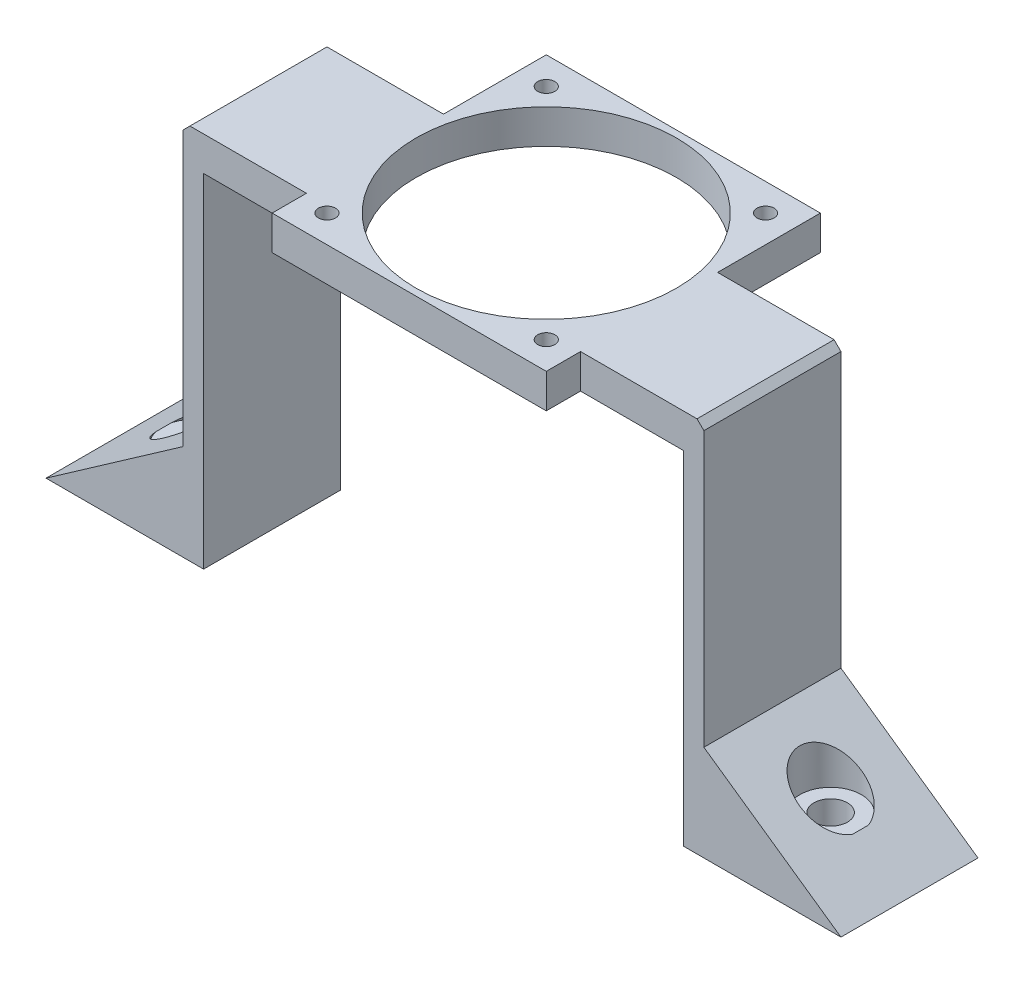
ISO-10303-21;
HEADER;
FILE_DESCRIPTION(('STEP AP214'),'2;1');
FILE_NAME('part.step','',(''),(''),'','','');
FILE_SCHEMA(('AUTOMOTIVE_DESIGN { 1 0 10303 214 1 1 1 1 }'));
ENDSEC;
DATA;
#1=APPLICATION_CONTEXT('core data for automotive mechanical design processes');
#2=APPLICATION_PROTOCOL_DEFINITION('international standard','automotive_design',2000,#1);
#3=PRODUCT_CONTEXT('',#1,'mechanical');
#4=PRODUCT('Part','Part','',(#3));
#5=PRODUCT_RELATED_PRODUCT_CATEGORY('part','',(#4));
#6=PRODUCT_DEFINITION_FORMATION('','',#4);
#7=PRODUCT_DEFINITION_CONTEXT('part definition',#1,'design');
#8=PRODUCT_DEFINITION('design','',#6,#7);
#9=PRODUCT_DEFINITION_SHAPE('','',#8);
#10=(LENGTH_UNIT() NAMED_UNIT(*) SI_UNIT(.MILLI.,.METRE.));
#11=(NAMED_UNIT(*) PLANE_ANGLE_UNIT() SI_UNIT($,.RADIAN.));
#12=(NAMED_UNIT(*) SI_UNIT($,.STERADIAN.) SOLID_ANGLE_UNIT());
#13=UNCERTAINTY_MEASURE_WITH_UNIT(LENGTH_MEASURE(1.E-05),#10,'distance_accuracy_value','');
#14=(GEOMETRIC_REPRESENTATION_CONTEXT(3) GLOBAL_UNCERTAINTY_ASSIGNED_CONTEXT((#13)) GLOBAL_UNIT_ASSIGNED_CONTEXT((#10,
#11,#12)) REPRESENTATION_CONTEXT('',''));
#15=CARTESIAN_POINT('',(0.,0.,0.));
#16=DIRECTION('',(0.,0.,1.));
#17=DIRECTION('',(1.,0.,0.));
#18=AXIS2_PLACEMENT_3D('',#15,#16,#17);
#19=CARTESIAN_POINT('',(-33.5855855855856,27.9887387387387,20.));
#20=DIRECTION('',(1.,0.,0.));
#21=DIRECTION('',(0.,1.,0.));
#22=AXIS2_PLACEMENT_3D('',#19,#20,#21);
#23=PLANE('',#22);
#24=DIRECTION('',(0.,-1.,0.));
#25=VECTOR('',#24,1.);
#26=CARTESIAN_POINT('',(-33.5855855855856,27.9887387387387,20.));
#27=LINE('',#26,#25);
#28=CARTESIAN_POINT('',(-33.5855855855856,28.9887387387387,20.));
#29=VERTEX_POINT('',#28);
#30=CARTESIAN_POINT('',(-33.5855855855856,-11.0217912524107,20.));
#31=VERTEX_POINT('',#30);
#32=EDGE_CURVE('E323',#29,#31,#27,.T.);
#33=ORIENTED_EDGE('',*,*,#32,.F.);
#34=DIRECTION('',(0.,0.,-1.));
#35=VECTOR('',#34,1.);
#36=CARTESIAN_POINT('',(-33.5855855855856,28.9887387387387,0.));
#37=LINE('',#36,#35);
#38=CARTESIAN_POINT('',(-33.5855855855856,28.9887387387387,0.));
#39=VERTEX_POINT('',#38);
#40=EDGE_CURVE('E85',#29,#39,#37,.T.);
#41=ORIENTED_EDGE('',*,*,#40,.T.);
#42=DIRECTION('',(0.,-1.,0.));
#43=VECTOR('',#42,1.);
#44=CARTESIAN_POINT('',(-33.5855855855856,27.9887387387387,0.));
#45=LINE('',#44,#43);
#46=CARTESIAN_POINT('',(-33.5855855855856,-11.0217912524107,0.));
#47=VERTEX_POINT('',#46);
#48=EDGE_CURVE('E333',#39,#47,#45,.T.);
#49=ORIENTED_EDGE('',*,*,#48,.T.);
#50=DIRECTION('',(0.,0.,-1.));
#51=VECTOR('',#50,1.);
#52=CARTESIAN_POINT('',(-33.5855855855856,-11.0217912524107,20.));
#53=LINE('',#52,#51);
#54=EDGE_CURVE('E263',#31,#47,#53,.T.);
#55=ORIENTED_EDGE('',*,*,#54,.F.);
#56=EDGE_LOOP('',(#33,#41,#49,#55));
#57=FACE_BOUND('',#56,.T.);
#58=ADVANCED_FACE('F76',(#57),#23,.F.);
#59=CARTESIAN_POINT('',(-30.5855855855856,24.9887387387387,20.));
#60=DIRECTION('',(-1.,0.,0.));
#61=DIRECTION('',(0.,-1.,0.));
#62=AXIS2_PLACEMENT_3D('',#59,#60,#61);
#63=PLANE('',#62);
#64=DIRECTION('',(0.,1.,0.));
#65=VECTOR('',#64,1.);
#66=CARTESIAN_POINT('',(-30.5855855855856,24.9887387387387,0.));
#67=LINE('',#66,#65);
#68=CARTESIAN_POINT('',(-30.5855855855856,-25.0112612612613,0.));
#69=VERTEX_POINT('',#68);
#70=CARTESIAN_POINT('',(-30.5855855855856,24.9887387387387,0.));
#71=VERTEX_POINT('',#70);
#72=EDGE_CURVE('E316',#69,#71,#67,.T.);
#73=ORIENTED_EDGE('',*,*,#72,.T.);
#74=DIRECTION('',(0.,0.,-1.));
#75=VECTOR('',#74,1.);
#76=CARTESIAN_POINT('',(-30.5855855855856,24.9887387387387,20.));
#77=LINE('',#76,#75);
#78=CARTESIAN_POINT('',(-30.5855855855856,24.9887387387387,20.));
#79=VERTEX_POINT('',#78);
#80=EDGE_CURVE('E338',#79,#71,#77,.T.);
#81=ORIENTED_EDGE('',*,*,#80,.F.);
#82=DIRECTION('',(0.,1.,0.));
#83=VECTOR('',#82,1.);
#84=CARTESIAN_POINT('',(-30.5855855855856,24.9887387387387,20.));
#85=LINE('',#84,#83);
#86=CARTESIAN_POINT('',(-30.5855855855856,-25.0112612612613,20.));
#87=VERTEX_POINT('',#86);
#88=EDGE_CURVE('E317',#87,#79,#85,.T.);
#89=ORIENTED_EDGE('',*,*,#88,.F.);
#90=DIRECTION('',(0.,0.,-1.));
#91=VECTOR('',#90,1.);
#92=CARTESIAN_POINT('',(-30.5855855855856,-25.0112612612613,20.));
#93=LINE('',#92,#91);
#94=EDGE_CURVE('E327',#87,#69,#93,.T.);
#95=ORIENTED_EDGE('',*,*,#94,.T.);
#96=EDGE_LOOP('',(#73,#81,#89,#95));
#97=FACE_BOUND('',#96,.T.);
#98=ADVANCED_FACE('F482',(#97),#63,.F.);
#99=CARTESIAN_POINT('',(-30.5855855855856,24.9887387387387,20.));
#100=DIRECTION('',(0.,1.,0.));
#101=DIRECTION('',(0.,0.,1.));
#102=AXIS2_PLACEMENT_3D('',#99,#100,#101);
#103=PLANE('',#102);
#104=DIRECTION('',(0.,0.,1.));
#105=VECTOR('',#104,1.);
#106=CARTESIAN_POINT('',(24.4144144144144,24.9887387387387,25.));
#107=LINE('',#106,#105);
#108=CARTESIAN_POINT('',(24.4144144144144,24.9887387387387,20.));
#109=VERTEX_POINT('',#108);
#110=CARTESIAN_POINT('',(24.4144144144144,24.9887387387387,25.));
#111=VERTEX_POINT('',#110);
#112=EDGE_CURVE('E410',#109,#111,#107,.T.);
#113=ORIENTED_EDGE('',*,*,#112,.T.);
#114=DIRECTION('',(1.,0.,0.));
#115=VECTOR('',#114,1.);
#116=CARTESIAN_POINT('',(24.4144144144144,24.9887387387387,25.));
#117=LINE('',#116,#115);
#118=CARTESIAN_POINT('',(-15.5855855855856,24.9887387387387,25.));
#119=VERTEX_POINT('',#118);
#120=EDGE_CURVE('E306',#119,#111,#117,.T.);
#121=ORIENTED_EDGE('',*,*,#120,.F.);
#122=DIRECTION('',(0.,0.,1.));
#123=VECTOR('',#122,1.);
#124=CARTESIAN_POINT('',(-15.5855855855856,24.9887387387387,25.));
#125=LINE('',#124,#123);
#126=CARTESIAN_POINT('',(-15.5855855855856,24.9887387387387,20.));
#127=VERTEX_POINT('',#126);
#128=EDGE_CURVE('E303',#127,#119,#125,.T.);
#129=ORIENTED_EDGE('',*,*,#128,.F.);
#130=DIRECTION('',(1.,0.,0.));
#131=VECTOR('',#130,1.);
#132=CARTESIAN_POINT('',(-30.5855855855856,24.9887387387387,20.));
#133=LINE('',#132,#131);
#134=EDGE_CURVE('E320',#79,#127,#133,.T.);
#135=ORIENTED_EDGE('',*,*,#134,.F.);
#136=ORIENTED_EDGE('',*,*,#80,.T.);
#137=DIRECTION('',(1.,0.,0.));
#138=VECTOR('',#137,1.);
#139=CARTESIAN_POINT('',(-30.5855855855856,24.9887387387387,0.));
#140=LINE('',#139,#138);
#141=CARTESIAN_POINT('',(-15.5855855855856,24.9887387387387,0.));
#142=VERTEX_POINT('',#141);
#143=EDGE_CURVE('E330',#71,#142,#140,.T.);
#144=ORIENTED_EDGE('',*,*,#143,.T.);
#145=CARTESIAN_POINT('',(-15.5855855855856,24.9887387387387,-15.));
#146=VERTEX_POINT('',#145);
#147=EDGE_CURVE('E304',#146,#142,#125,.T.);
#148=ORIENTED_EDGE('',*,*,#147,.F.);
#149=DIRECTION('',(-1.,0.,0.));
#150=VECTOR('',#149,1.);
#151=CARTESIAN_POINT('',(24.4144144144144,24.9887387387387,-15.));
#152=LINE('',#151,#150);
#153=CARTESIAN_POINT('',(24.4144144144144,24.9887387387387,-15.));
#154=VERTEX_POINT('',#153);
#155=EDGE_CURVE('E301',#154,#146,#152,.T.);
#156=ORIENTED_EDGE('',*,*,#155,.F.);
#157=CARTESIAN_POINT('',(24.4144144144144,24.9887387387387,0.));
#158=VERTEX_POINT('',#157);
#159=EDGE_CURVE('E413',#154,#158,#107,.T.);
#160=ORIENTED_EDGE('',*,*,#159,.T.);
#161=DIRECTION('',(-1.,0.,0.));
#162=VECTOR('',#161,1.);
#163=CARTESIAN_POINT('',(39.4144144144144,24.9887387387387,0.));
#164=LINE('',#163,#162);
#165=CARTESIAN_POINT('',(39.4144144144144,24.9887387387387,0.));
#166=VERTEX_POINT('',#165);
#167=EDGE_CURVE('E379',#166,#158,#164,.T.);
#168=ORIENTED_EDGE('',*,*,#167,.F.);
#169=DIRECTION('',(0.,0.,-1.));
#170=VECTOR('',#169,1.);
#171=CARTESIAN_POINT('',(39.4144144144145,24.9887387387387,20.));
#172=LINE('',#171,#170);
#173=CARTESIAN_POINT('',(39.4144144144145,24.9887387387387,20.));
#174=VERTEX_POINT('',#173);
#175=EDGE_CURVE('E247',#174,#166,#172,.T.);
#176=ORIENTED_EDGE('',*,*,#175,.F.);
#177=DIRECTION('',(-1.,0.,0.));
#178=VECTOR('',#177,1.);
#179=CARTESIAN_POINT('',(39.4144144144145,24.9887387387387,20.));
#180=LINE('',#179,#178);
#181=EDGE_CURVE('E428',#174,#109,#180,.T.);
#182=ORIENTED_EDGE('',*,*,#181,.T.);
#183=EDGE_LOOP('',(#113,#121,#129,#135,#136,#144,#148,#156,#160,#168,#176,#182));
#184=FACE_BOUND('',#183,.T.);
#185=CARTESIAN_POINT('',(-11.5855855855856,24.9887387387387,-11.));
#186=DIRECTION('',(0.,1.,0.));
#187=DIRECTION('',(0.,0.,1.));
#188=AXIS2_PLACEMENT_3D('',#185,#186,#187);
#189=CIRCLE('',#188,1.25);
#190=CARTESIAN_POINT('',(-11.5855855855856,24.9887387387387,-9.75));
#191=VERTEX_POINT('',#190);
#192=EDGE_CURVE('E292',#191,#191,#189,.T.);
#193=ORIENTED_EDGE('',*,*,#192,.T.);
#194=EDGE_LOOP('',(#193));
#195=FACE_BOUND('',#194,.T.);
#196=CARTESIAN_POINT('',(-11.5855855855856,24.9887387387387,21.));
#197=DIRECTION('',(0.,1.,0.));
#198=DIRECTION('',(0.,0.,1.));
#199=AXIS2_PLACEMENT_3D('',#196,#197,#198);
#200=CIRCLE('',#199,1.25);
#201=CARTESIAN_POINT('',(-11.5855855855856,24.9887387387387,22.25));
#202=VERTEX_POINT('',#201);
#203=EDGE_CURVE('E293',#202,#202,#200,.T.);
#204=ORIENTED_EDGE('',*,*,#203,.T.);
#205=EDGE_LOOP('',(#204));
#206=FACE_BOUND('',#205,.T.);
#207=CARTESIAN_POINT('',(4.41441441441443,24.9887387387387,5.));
#208=DIRECTION('',(0.,1.,0.));
#209=DIRECTION('',(0.,0.,1.));
#210=AXIS2_PLACEMENT_3D('',#207,#208,#209);
#211=CIRCLE('',#210,19.);
#212=CARTESIAN_POINT('',(4.41441441441443,24.9887387387387,24.));
#213=VERTEX_POINT('',#212);
#214=EDGE_CURVE('E296',#213,#213,#211,.T.);
#215=ORIENTED_EDGE('',*,*,#214,.T.);
#216=EDGE_LOOP('',(#215));
#217=FACE_BOUND('',#216,.T.);
#218=CARTESIAN_POINT('',(20.4144144144144,24.9887387387387,-11.));
#219=DIRECTION('',(0.,-1.,0.));
#220=DIRECTION('',(0.,0.,1.));
#221=AXIS2_PLACEMENT_3D('',#218,#219,#220);
#222=CIRCLE('',#221,1.25);
#223=CARTESIAN_POINT('',(20.4144144144144,24.9887387387387,-9.75));
#224=VERTEX_POINT('',#223);
#225=EDGE_CURVE('E406',#224,#224,#222,.T.);
#226=ORIENTED_EDGE('',*,*,#225,.F.);
#227=EDGE_LOOP('',(#226));
#228=FACE_BOUND('',#227,.T.);
#229=CARTESIAN_POINT('',(20.4144144144144,24.9887387387387,21.));
#230=DIRECTION('',(0.,-1.,0.));
#231=DIRECTION('',(0.,0.,1.));
#232=AXIS2_PLACEMENT_3D('',#229,#230,#231);
#233=CIRCLE('',#232,1.25);
#234=CARTESIAN_POINT('',(20.4144144144144,24.9887387387387,22.25));
#235=VERTEX_POINT('',#234);
#236=EDGE_CURVE('E407',#235,#235,#233,.T.);
#237=ORIENTED_EDGE('',*,*,#236,.F.);
#238=EDGE_LOOP('',(#237));
#239=FACE_BOUND('',#238,.T.);
#240=ADVANCED_FACE('F460',(#184,#195,#206,#217,#228,#239),#103,.F.);
#241=CARTESIAN_POINT('',(-30.5855855855856,-25.0112612612613,20.));
#242=DIRECTION('',(0.,1.,0.));
#243=DIRECTION('',(-1.,0.,0.));
#244=AXIS2_PLACEMENT_3D('',#241,#242,#243);
#245=PLANE('',#244);
#246=CARTESIAN_POINT('',(-42.0855855855856,-25.0112612612613,10.));
#247=DIRECTION('',(0.,-1.,0.));
#248=DIRECTION('',(1.,0.,0.));
#249=AXIS2_PLACEMENT_3D('',#246,#247,#248);
#250=CIRCLE('',#249,2.45);
#251=CARTESIAN_POINT('',(-39.6355855855856,-25.0112612612613,10.));
#252=VERTEX_POINT('',#251);
#253=EDGE_CURVE('E253',#252,#252,#250,.T.);
#254=ORIENTED_EDGE('',*,*,#253,.F.);
#255=EDGE_LOOP('',(#254));
#256=FACE_BOUND('',#255,.T.);
#257=DIRECTION('',(1.,0.,0.));
#258=VECTOR('',#257,1.);
#259=CARTESIAN_POINT('',(-30.5855855855856,-25.0112612612613,0.));
#260=LINE('',#259,#258);
#261=CARTESIAN_POINT('',(-53.5855855855856,-25.0112612612613,0.));
#262=VERTEX_POINT('',#261);
#263=EDGE_CURVE('E321',#262,#69,#260,.T.);
#264=ORIENTED_EDGE('',*,*,#263,.T.);
#265=ORIENTED_EDGE('',*,*,#94,.F.);
#266=DIRECTION('',(1.,0.,0.));
#267=VECTOR('',#266,1.);
#268=CARTESIAN_POINT('',(-30.5855855855856,-25.0112612612613,20.));
#269=LINE('',#268,#267);
#270=CARTESIAN_POINT('',(-53.5855855855856,-25.0112612612613,20.));
#271=VERTEX_POINT('',#270);
#272=EDGE_CURVE('E325',#271,#87,#269,.T.);
#273=ORIENTED_EDGE('',*,*,#272,.F.);
#274=DIRECTION('',(0.,0.,-1.));
#275=VECTOR('',#274,1.);
#276=CARTESIAN_POINT('',(-53.5855855855856,-25.0112612612613,20.));
#277=LINE('',#276,#275);
#278=EDGE_CURVE('E260',#271,#262,#277,.T.);
#279=ORIENTED_EDGE('',*,*,#278,.T.);
#280=EDGE_LOOP('',(#264,#265,#273,#279));
#281=FACE_BOUND('',#280,.T.);
#282=ADVANCED_FACE('F514',(#256,#281),#245,.F.);
#283=CARTESIAN_POINT('',(0.,0.,20.));
#284=DIRECTION('',(0.,0.,-1.));
#285=DIRECTION('',(-1.,0.,0.));
#286=AXIS2_PLACEMENT_3D('',#283,#284,#285);
#287=PLANE('',#286);
#288=DIRECTION('',(1.,0.,0.));
#289=VECTOR('',#288,1.);
#290=CARTESIAN_POINT('',(-33.5855855855856,29.9887387387387,20.));
#291=LINE('',#290,#289);
#292=CARTESIAN_POINT('',(-32.5855855855856,29.9887387387387,20.));
#293=VERTEX_POINT('',#292);
#294=CARTESIAN_POINT('',(-15.5855855855856,29.9887387387387,20.));
#295=VERTEX_POINT('',#294);
#296=EDGE_CURVE('E277',#293,#295,#291,.T.);
#297=ORIENTED_EDGE('',*,*,#296,.F.);
#298=DIRECTION('',(-0.707106781186543,-0.707106781186552,0.));
#299=VECTOR('',#298,1.);
#300=CARTESIAN_POINT('',(-32.5855855855856,29.9887387387387,20.));
#301=LINE('',#300,#299);
#302=EDGE_CURVE('E99',#293,#29,#301,.T.);
#303=ORIENTED_EDGE('',*,*,#302,.T.);
#304=ORIENTED_EDGE('',*,*,#32,.T.);
#305=DIRECTION('',(0.819434555491074,0.573172756912911,0.));
#306=VECTOR('',#305,1.);
#307=CARTESIAN_POINT('',(-53.5855855855856,-25.0112612612613,20.));
#308=LINE('',#307,#306);
#309=EDGE_CURVE('E257',#271,#31,#308,.T.);
#310=ORIENTED_EDGE('',*,*,#309,.F.);
#311=ORIENTED_EDGE('',*,*,#272,.T.);
#312=ORIENTED_EDGE('',*,*,#88,.T.);
#313=ORIENTED_EDGE('',*,*,#134,.T.);
#314=DIRECTION('',(0.,1.,0.));
#315=VECTOR('',#314,1.);
#316=CARTESIAN_POINT('',(-15.5855855855856,0.,20.));
#317=LINE('',#316,#315);
#318=EDGE_CURVE('E311',#127,#295,#317,.T.);
#319=ORIENTED_EDGE('',*,*,#318,.T.);
#320=EDGE_LOOP('',(#297,#303,#304,#310,#311,#312,#313,#319));
#321=FACE_BOUND('',#320,.T.);
#322=ADVANCED_FACE('F476',(#321),#287,.F.);
#323=CARTESIAN_POINT('',(0.,0.,0.));
#324=DIRECTION('',(0.,0.,-1.));
#325=DIRECTION('',(-1.,0.,0.));
#326=AXIS2_PLACEMENT_3D('',#323,#324,#325);
#327=PLANE('',#326);
#328=ORIENTED_EDGE('',*,*,#48,.F.);
#329=DIRECTION('',(0.707106781186543,0.707106781186552,0.));
#330=VECTOR('',#329,1.);
#331=CARTESIAN_POINT('',(-31.2871621621624,31.287162162162,0.));
#332=LINE('',#331,#330);
#333=CARTESIAN_POINT('',(-32.5855855855856,29.9887387387387,0.));
#334=VERTEX_POINT('',#333);
#335=EDGE_CURVE('E12',#39,#334,#332,.T.);
#336=ORIENTED_EDGE('',*,*,#335,.T.);
#337=DIRECTION('',(-1.,0.,0.));
#338=VECTOR('',#337,1.);
#339=CARTESIAN_POINT('',(-15.5855855855856,29.9887387387387,0.));
#340=LINE('',#339,#338);
#341=CARTESIAN_POINT('',(-15.5855855855856,29.9887387387387,0.));
#342=VERTEX_POINT('',#341);
#343=EDGE_CURVE('E289',#342,#334,#340,.T.);
#344=ORIENTED_EDGE('',*,*,#343,.F.);
#345=DIRECTION('',(0.,1.,0.));
#346=VECTOR('',#345,1.);
#347=CARTESIAN_POINT('',(-15.5855855855856,0.,0.));
#348=LINE('',#347,#346);
#349=EDGE_CURVE('E341',#142,#342,#348,.T.);
#350=ORIENTED_EDGE('',*,*,#349,.F.);
#351=ORIENTED_EDGE('',*,*,#143,.F.);
#352=ORIENTED_EDGE('',*,*,#72,.F.);
#353=ORIENTED_EDGE('',*,*,#263,.F.);
#354=DIRECTION('',(0.819434555491074,0.573172756912911,0.));
#355=VECTOR('',#354,1.);
#356=CARTESIAN_POINT('',(-53.5855855855856,-25.0112612612613,0.));
#357=LINE('',#356,#355);
#358=EDGE_CURVE('E256',#262,#47,#357,.T.);
#359=ORIENTED_EDGE('',*,*,#358,.T.);
#360=EDGE_LOOP('',(#328,#336,#344,#350,#351,#352,#353,#359));
#361=FACE_BOUND('',#360,.T.);
#362=ADVANCED_FACE('F485',(#361),#327,.T.);
#363=CARTESIAN_POINT('',(24.4144144144144,24.9887387387387,-15.));
#364=DIRECTION('',(0.,0.,-1.));
#365=DIRECTION('',(-1.,0.,0.));
#366=AXIS2_PLACEMENT_3D('',#363,#364,#365);
#367=PLANE('',#366);
#368=DIRECTION('',(-1.,0.,0.));
#369=VECTOR('',#368,1.);
#370=CARTESIAN_POINT('',(24.4144144144144,29.9887387387387,-15.));
#371=LINE('',#370,#369);
#372=CARTESIAN_POINT('',(24.4144144144144,29.9887387387387,-15.));
#373=VERTEX_POINT('',#372);
#374=CARTESIAN_POINT('',(-15.5855855855856,29.9887387387387,-15.));
#375=VERTEX_POINT('',#374);
#376=EDGE_CURVE('E284',#373,#375,#371,.T.);
#377=ORIENTED_EDGE('',*,*,#376,.F.);
#378=DIRECTION('',(0.,1.,0.));
#379=VECTOR('',#378,1.);
#380=CARTESIAN_POINT('',(24.4144144144144,24.9887387387387,-15.));
#381=LINE('',#380,#379);
#382=EDGE_CURVE('E416',#154,#373,#381,.T.);
#383=ORIENTED_EDGE('',*,*,#382,.F.);
#384=ORIENTED_EDGE('',*,*,#155,.T.);
#385=DIRECTION('',(0.,1.,0.));
#386=VECTOR('',#385,1.);
#387=CARTESIAN_POINT('',(-15.5855855855856,24.9887387387387,-15.));
#388=LINE('',#387,#386);
#389=EDGE_CURVE('E308',#146,#375,#388,.T.);
#390=ORIENTED_EDGE('',*,*,#389,.T.);
#391=EDGE_LOOP('',(#377,#383,#384,#390));
#392=FACE_BOUND('',#391,.T.);
#393=ADVANCED_FACE('F495',(#392),#367,.T.);
#394=CARTESIAN_POINT('',(-15.5855855855856,24.9887387387387,25.));
#395=DIRECTION('',(-1.,0.,0.));
#396=DIRECTION('',(0.,0.,1.));
#397=AXIS2_PLACEMENT_3D('',#394,#395,#396);
#398=PLANE('',#397);
#399=ORIENTED_EDGE('',*,*,#147,.T.);
#400=ORIENTED_EDGE('',*,*,#349,.T.);
#401=DIRECTION('',(0.,0.,1.));
#402=VECTOR('',#401,1.);
#403=CARTESIAN_POINT('',(-15.5855855855856,29.9887387387387,-15.));
#404=LINE('',#403,#402);
#405=EDGE_CURVE('E286',#375,#342,#404,.T.);
#406=ORIENTED_EDGE('',*,*,#405,.F.);
#407=ORIENTED_EDGE('',*,*,#389,.F.);
#408=EDGE_LOOP('',(#399,#400,#406,#407));
#409=FACE_BOUND('',#408,.T.);
#410=ADVANCED_FACE('F492',(#409),#398,.T.);
#411=ORIENTED_EDGE('',*,*,#318,.F.);
#412=ORIENTED_EDGE('',*,*,#128,.T.);
#413=DIRECTION('',(0.,1.,0.));
#414=VECTOR('',#413,1.);
#415=CARTESIAN_POINT('',(-15.5855855855856,24.9887387387387,25.));
#416=LINE('',#415,#414);
#417=CARTESIAN_POINT('',(-15.5855855855856,29.9887387387387,25.));
#418=VERTEX_POINT('',#417);
#419=EDGE_CURVE('E309',#119,#418,#416,.T.);
#420=ORIENTED_EDGE('',*,*,#419,.T.);
#421=DIRECTION('',(0.,0.,1.));
#422=VECTOR('',#421,1.);
#423=CARTESIAN_POINT('',(-15.5855855855856,29.9887387387387,20.));
#424=LINE('',#423,#422);
#425=EDGE_CURVE('E279',#295,#418,#424,.T.);
#426=ORIENTED_EDGE('',*,*,#425,.F.);
#427=EDGE_LOOP('',(#411,#412,#420,#426));
#428=FACE_BOUND('',#427,.T.);
#429=ADVANCED_FACE('F474',(#428),#398,.T.);
#430=CARTESIAN_POINT('',(24.4144144144144,24.9887387387387,25.));
#431=DIRECTION('',(0.,0.,1.));
#432=DIRECTION('',(1.,0.,0.));
#433=AXIS2_PLACEMENT_3D('',#430,#431,#432);
#434=PLANE('',#433);
#435=ORIENTED_EDGE('',*,*,#120,.T.);
#436=DIRECTION('',(0.,1.,0.));
#437=VECTOR('',#436,1.);
#438=CARTESIAN_POINT('',(24.4144144144144,24.9887387387387,25.));
#439=LINE('',#438,#437);
#440=CARTESIAN_POINT('',(24.4144144144144,29.9887387387387,25.));
#441=VERTEX_POINT('',#440);
#442=EDGE_CURVE('E417',#111,#441,#439,.T.);
#443=ORIENTED_EDGE('',*,*,#442,.T.);
#444=DIRECTION('',(1.,0.,0.));
#445=VECTOR('',#444,1.);
#446=CARTESIAN_POINT('',(-15.5855855855856,29.9887387387387,25.));
#447=LINE('',#446,#445);
#448=EDGE_CURVE('E282',#418,#441,#447,.T.);
#449=ORIENTED_EDGE('',*,*,#448,.F.);
#450=ORIENTED_EDGE('',*,*,#419,.F.);
#451=EDGE_LOOP('',(#435,#443,#449,#450));
#452=FACE_BOUND('',#451,.T.);
#453=ADVANCED_FACE('F469',(#452),#434,.T.);
#454=CARTESIAN_POINT('',(4.41441441441443,24.9887387387387,5.));
#455=DIRECTION('',(0.,1.,0.));
#456=DIRECTION('',(0.,0.,1.));
#457=AXIS2_PLACEMENT_3D('',#454,#455,#456);
#458=CYLINDRICAL_SURFACE('',#457,19.);
#459=ORIENTED_EDGE('',*,*,#214,.F.);
#460=EDGE_LOOP('',(#459));
#461=FACE_BOUND('',#460,.T.);
#462=CARTESIAN_POINT('',(4.41441441441443,29.9887387387387,5.));
#463=DIRECTION('',(0.,1.,0.));
#464=DIRECTION('',(0.,0.,1.));
#465=AXIS2_PLACEMENT_3D('',#462,#463,#464);
#466=CIRCLE('',#465,19.);
#467=CARTESIAN_POINT('',(4.41441441441443,29.9887387387387,24.));
#468=VERTEX_POINT('',#467);
#469=EDGE_CURVE('E272',#468,#468,#466,.T.);
#470=ORIENTED_EDGE('',*,*,#469,.T.);
#471=EDGE_LOOP('',(#470));
#472=FACE_BOUND('',#471,.T.);
#473=ADVANCED_FACE('F556',(#461,#472),#458,.F.);
#474=CARTESIAN_POINT('',(-11.5855855855856,24.9887387387387,21.));
#475=DIRECTION('',(0.,1.,0.));
#476=DIRECTION('',(0.,0.,1.));
#477=AXIS2_PLACEMENT_3D('',#474,#475,#476);
#478=CYLINDRICAL_SURFACE('',#477,1.25);
#479=ORIENTED_EDGE('',*,*,#203,.F.);
#480=EDGE_LOOP('',(#479));
#481=FACE_BOUND('',#480,.T.);
#482=CARTESIAN_POINT('',(-11.5855855855856,29.9887387387387,21.));
#483=DIRECTION('',(0.,-1.,0.));
#484=DIRECTION('',(0.,0.,-1.));
#485=AXIS2_PLACEMENT_3D('',#482,#483,#484);
#486=CIRCLE('',#485,1.25);
#487=CARTESIAN_POINT('',(-11.5855855855856,29.9887387387387,19.75));
#488=VERTEX_POINT('',#487);
#489=EDGE_CURVE('E266',#488,#488,#486,.T.);
#490=ORIENTED_EDGE('',*,*,#489,.F.);
#491=EDGE_LOOP('',(#490));
#492=FACE_BOUND('',#491,.T.);
#493=ADVANCED_FACE('F553',(#481,#492),#478,.F.);
#494=CARTESIAN_POINT('',(-11.5855855855856,24.9887387387387,-11.));
#495=DIRECTION('',(0.,1.,0.));
#496=DIRECTION('',(0.,0.,1.));
#497=AXIS2_PLACEMENT_3D('',#494,#495,#496);
#498=CYLINDRICAL_SURFACE('',#497,1.25);
#499=ORIENTED_EDGE('',*,*,#192,.F.);
#500=EDGE_LOOP('',(#499));
#501=FACE_BOUND('',#500,.T.);
#502=CARTESIAN_POINT('',(-11.5855855855856,29.9887387387387,-11.));
#503=DIRECTION('',(0.,-1.,0.));
#504=DIRECTION('',(0.,0.,-1.));
#505=AXIS2_PLACEMENT_3D('',#502,#503,#504);
#506=CIRCLE('',#505,1.25);
#507=CARTESIAN_POINT('',(-11.5855855855856,29.9887387387387,-12.25));
#508=VERTEX_POINT('',#507);
#509=EDGE_CURVE('E269',#508,#508,#506,.T.);
#510=ORIENTED_EDGE('',*,*,#509,.F.);
#511=EDGE_LOOP('',(#510));
#512=FACE_BOUND('',#511,.T.);
#513=ADVANCED_FACE('F548',(#501,#512),#498,.F.);
#514=CARTESIAN_POINT('',(0.,29.9887387387387,0.));
#515=DIRECTION('',(0.,1.,0.));
#516=DIRECTION('',(0.,0.,1.));
#517=AXIS2_PLACEMENT_3D('',#514,#515,#516);
#518=PLANE('',#517);
#519=DIRECTION('',(-1.,0.,0.));
#520=VECTOR('',#519,1.);
#521=CARTESIAN_POINT('',(42.4144144144145,29.9887387387387,20.));
#522=LINE('',#521,#520);
#523=CARTESIAN_POINT('',(41.4144144144144,29.9887387387387,20.));
#524=VERTEX_POINT('',#523);
#525=CARTESIAN_POINT('',(24.4144144144144,29.9887387387387,20.));
#526=VERTEX_POINT('',#525);
#527=EDGE_CURVE('E385',#524,#526,#522,.T.);
#528=ORIENTED_EDGE('',*,*,#527,.F.);
#529=DIRECTION('',(0.,0.,-1.));
#530=VECTOR('',#529,1.);
#531=CARTESIAN_POINT('',(41.4144144144144,29.9887387387387,0.));
#532=LINE('',#531,#530);
#533=CARTESIAN_POINT('',(41.4144144144144,29.9887387387387,0.));
#534=VERTEX_POINT('',#533);
#535=EDGE_CURVE('E356',#524,#534,#532,.T.);
#536=ORIENTED_EDGE('',*,*,#535,.T.);
#537=DIRECTION('',(1.,0.,0.));
#538=VECTOR('',#537,1.);
#539=CARTESIAN_POINT('',(24.4144144144144,29.9887387387387,0.));
#540=LINE('',#539,#538);
#541=CARTESIAN_POINT('',(24.4144144144144,29.9887387387387,0.));
#542=VERTEX_POINT('',#541);
#543=EDGE_CURVE('E368',#542,#534,#540,.T.);
#544=ORIENTED_EDGE('',*,*,#543,.F.);
#545=DIRECTION('',(0.,0.,1.));
#546=VECTOR('',#545,1.);
#547=CARTESIAN_POINT('',(24.4144144144144,29.9887387387387,-15.));
#548=LINE('',#547,#546);
#549=EDGE_CURVE('E397',#373,#542,#548,.T.);
#550=ORIENTED_EDGE('',*,*,#549,.F.);
#551=ORIENTED_EDGE('',*,*,#376,.T.);
#552=ORIENTED_EDGE('',*,*,#405,.T.);
#553=ORIENTED_EDGE('',*,*,#343,.T.);
#554=DIRECTION('',(0.,0.,1.));
#555=VECTOR('',#554,1.);
#556=CARTESIAN_POINT('',(-32.5855855855856,29.9887387387387,20.));
#557=LINE('',#556,#555);
#558=EDGE_CURVE('E353',#334,#293,#557,.T.);
#559=ORIENTED_EDGE('',*,*,#558,.T.);
#560=ORIENTED_EDGE('',*,*,#296,.T.);
#561=ORIENTED_EDGE('',*,*,#425,.T.);
#562=ORIENTED_EDGE('',*,*,#448,.T.);
#563=DIRECTION('',(0.,0.,1.));
#564=VECTOR('',#563,1.);
#565=CARTESIAN_POINT('',(24.4144144144144,29.9887387387387,20.));
#566=LINE('',#565,#564);
#567=EDGE_CURVE('E393',#526,#441,#566,.T.);
#568=ORIENTED_EDGE('',*,*,#567,.F.);
#569=EDGE_LOOP('',(#528,#536,#544,#550,#551,#552,#553,#559,#560,#561,#562,#568));
#570=FACE_BOUND('',#569,.T.);
#571=ORIENTED_EDGE('',*,*,#469,.F.);
#572=EDGE_LOOP('',(#571));
#573=FACE_BOUND('',#572,.T.);
#574=ORIENTED_EDGE('',*,*,#489,.T.);
#575=EDGE_LOOP('',(#574));
#576=FACE_BOUND('',#575,.T.);
#577=ORIENTED_EDGE('',*,*,#509,.T.);
#578=EDGE_LOOP('',(#577));
#579=FACE_BOUND('',#578,.T.);
#580=CARTESIAN_POINT('',(20.4144144144144,29.9887387387387,21.));
#581=DIRECTION('',(0.,1.,0.));
#582=DIRECTION('',(0.,0.,-1.));
#583=AXIS2_PLACEMENT_3D('',#580,#581,#582);
#584=CIRCLE('',#583,1.25);
#585=CARTESIAN_POINT('',(20.4144144144144,29.9887387387387,19.75));
#586=VERTEX_POINT('',#585);
#587=EDGE_CURVE('E400',#586,#586,#584,.T.);
#588=ORIENTED_EDGE('',*,*,#587,.F.);
#589=EDGE_LOOP('',(#588));
#590=FACE_BOUND('',#589,.T.);
#591=CARTESIAN_POINT('',(20.4144144144144,29.9887387387387,-11.));
#592=DIRECTION('',(0.,1.,0.));
#593=DIRECTION('',(0.,0.,-1.));
#594=AXIS2_PLACEMENT_3D('',#591,#592,#593);
#595=CIRCLE('',#594,1.25);
#596=CARTESIAN_POINT('',(20.4144144144144,29.9887387387387,-12.25));
#597=VERTEX_POINT('',#596);
#598=EDGE_CURVE('E395',#597,#597,#595,.T.);
#599=ORIENTED_EDGE('',*,*,#598,.F.);
#600=EDGE_LOOP('',(#599));
#601=FACE_BOUND('',#600,.T.);
#602=ADVANCED_FACE('F390',(#570,#573,#576,#579,#590,#601),#518,.T.);
#603=CARTESIAN_POINT('',(-53.5855855855856,-25.0112612612613,20.));
#604=DIRECTION('',(-0.573172756912911,0.819434555491074,0.));
#605=DIRECTION('',(-0.819434555491074,-0.573172756912911,0.));
#606=AXIS2_PLACEMENT_3D('',#603,#604,#605);
#607=PLANE('',#606);
#608=CARTESIAN_POINT('',(-42.0855855855856,-16.9673160061722,10.));
#609=DIRECTION('',(-0.573172756912911,0.819434555491074,0.));
#610=DIRECTION('',(-0.819434555491074,-0.573172756912911,0.));
#611=AXIS2_PLACEMENT_3D('',#608,#609,#610);
#612=ELLIPSE('',#611,5.49159169557259,4.5);
#613=CARTESIAN_POINT('',(-46.4373519543806,-20.0112612612613,11.1454822003964));
#614=VERTEX_POINT('',#613);
#615=CARTESIAN_POINT('',(-46.4373519543806,-20.0112612612613,8.85451779960365));
#616=VERTEX_POINT('',#615);
#617=EDGE_CURVE('E343',#614,#616,#612,.T.);
#618=ORIENTED_EDGE('',*,*,#617,.F.);
#619=DIRECTION('',(0.,0.,1.));
#620=VECTOR('',#619,1.);
#621=CARTESIAN_POINT('',(-46.4373519543806,-20.0112612612613,20.));
#622=LINE('',#621,#620);
#623=EDGE_CURVE('E251',#616,#614,#622,.T.);
#624=ORIENTED_EDGE('',*,*,#623,.F.);
#625=EDGE_LOOP('',(#618,#624));
#626=FACE_BOUND('',#625,.T.);
#627=ORIENTED_EDGE('',*,*,#358,.F.);
#628=ORIENTED_EDGE('',*,*,#278,.F.);
#629=ORIENTED_EDGE('',*,*,#309,.T.);
#630=ORIENTED_EDGE('',*,*,#54,.T.);
#631=EDGE_LOOP('',(#627,#628,#629,#630));
#632=FACE_BOUND('',#631,.T.);
#633=ADVANCED_FACE('F535',(#626,#632),#607,.T.);
#634=CARTESIAN_POINT('',(-42.0855855855857,33.9887387387387,10.));
#635=DIRECTION('',(0.,-1.,0.));
#636=DIRECTION('',(1.,0.,0.));
#637=AXIS2_PLACEMENT_3D('',#634,#635,#636);
#638=CYLINDRICAL_SURFACE('',#637,2.45);
#639=CARTESIAN_POINT('',(-42.0855855855856,-20.0112612612613,10.));
#640=DIRECTION('',(0.,-1.,0.));
#641=DIRECTION('',(1.,0.,0.));
#642=AXIS2_PLACEMENT_3D('',#639,#640,#641);
#643=CIRCLE('',#642,2.45);
#644=CARTESIAN_POINT('',(-39.6355855855856,-20.0112612612613,10.));
#645=VERTEX_POINT('',#644);
#646=EDGE_CURVE('E244',#645,#645,#643,.F.);
#647=ORIENTED_EDGE('',*,*,#646,.T.);
#648=EDGE_LOOP('',(#647));
#649=FACE_BOUND('',#648,.T.);
#650=ORIENTED_EDGE('',*,*,#253,.T.);
#651=EDGE_LOOP('',(#650));
#652=FACE_BOUND('',#651,.T.);
#653=ADVANCED_FACE('F538',(#649,#652),#638,.F.);
#654=CARTESIAN_POINT('',(-42.0855855855856,-20.0112612612613,10.));
#655=DIRECTION('',(0.,-1.,0.));
#656=DIRECTION('',(1.,0.,0.));
#657=AXIS2_PLACEMENT_3D('',#654,#655,#656);
#658=PLANE('',#657);
#659=ORIENTED_EDGE('',*,*,#623,.T.);
#660=CARTESIAN_POINT('',(-42.0855855855856,-20.0112612612613,10.));
#661=DIRECTION('',(0.,-1.,0.));
#662=DIRECTION('',(1.,0.,0.));
#663=AXIS2_PLACEMENT_3D('',#660,#661,#662);
#664=CIRCLE('',#663,4.5);
#665=EDGE_CURVE('E240',#616,#614,#664,.T.);
#666=ORIENTED_EDGE('',*,*,#665,.F.);
#667=EDGE_LOOP('',(#659,#666));
#668=FACE_BOUND('',#667,.T.);
#669=ORIENTED_EDGE('',*,*,#646,.F.);
#670=EDGE_LOOP('',(#669));
#671=FACE_BOUND('',#670,.T.);
#672=ADVANCED_FACE('F545',(#668,#671),#658,.F.);
#673=CARTESIAN_POINT('',(-42.0855855855857,38.9887387387387,10.));
#674=DIRECTION('',(0.,-1.,0.));
#675=DIRECTION('',(1.,0.,0.));
#676=AXIS2_PLACEMENT_3D('',#673,#674,#675);
#677=CYLINDRICAL_SURFACE('',#676,4.5);
#678=ORIENTED_EDGE('',*,*,#617,.T.);
#679=ORIENTED_EDGE('',*,*,#665,.T.);
#680=EDGE_LOOP('',(#678,#679));
#681=FACE_BOUND('',#680,.T.);
#682=ADVANCED_FACE('F625',(#681),#677,.F.);
#683=CARTESIAN_POINT('',(42.4144144144145,27.9887387387387,20.));
#684=DIRECTION('',(-1.,0.,0.));
#685=DIRECTION('',(0.,1.,0.));
#686=AXIS2_PLACEMENT_3D('',#683,#684,#685);
#687=PLANE('',#686);
#688=DIRECTION('',(0.,-1.,0.));
#689=VECTOR('',#688,1.);
#690=CARTESIAN_POINT('',(42.4144144144144,27.9887387387387,0.));
#691=LINE('',#690,#689);
#692=CARTESIAN_POINT('',(42.4144144144144,28.9887387387387,0.));
#693=VERTEX_POINT('',#692);
#694=CARTESIAN_POINT('',(42.4144144144144,-11.0217912524107,0.));
#695=VERTEX_POINT('',#694);
#696=EDGE_CURVE('E365',#693,#695,#691,.T.);
#697=ORIENTED_EDGE('',*,*,#696,.F.);
#698=DIRECTION('',(0.,0.,1.));
#699=VECTOR('',#698,1.);
#700=CARTESIAN_POINT('',(42.4144144144145,28.9887387387387,20.));
#701=LINE('',#700,#699);
#702=CARTESIAN_POINT('',(42.4144144144145,28.9887387387387,20.));
#703=VERTEX_POINT('',#702);
#704=EDGE_CURVE('E348',#693,#703,#701,.T.);
#705=ORIENTED_EDGE('',*,*,#704,.T.);
#706=DIRECTION('',(0.,-1.,0.));
#707=VECTOR('',#706,1.);
#708=CARTESIAN_POINT('',(42.4144144144145,27.9887387387387,20.));
#709=LINE('',#708,#707);
#710=CARTESIAN_POINT('',(42.4144144144144,-11.0217912524107,20.));
#711=VERTEX_POINT('',#710);
#712=EDGE_CURVE('E388',#703,#711,#709,.T.);
#713=ORIENTED_EDGE('',*,*,#712,.T.);
#714=DIRECTION('',(0.,0.,-1.));
#715=VECTOR('',#714,1.);
#716=CARTESIAN_POINT('',(42.4144144144144,-11.0217912524107,20.));
#717=LINE('',#716,#715);
#718=EDGE_CURVE('E377',#711,#695,#717,.T.);
#719=ORIENTED_EDGE('',*,*,#718,.T.);
#720=EDGE_LOOP('',(#697,#705,#713,#719));
#721=FACE_BOUND('',#720,.T.);
#722=ADVANCED_FACE('F374',(#721),#687,.F.);
#723=CARTESIAN_POINT('',(39.4144144144145,24.9887387387387,20.));
#724=DIRECTION('',(1.,0.,0.));
#725=DIRECTION('',(0.,-1.,0.));
#726=AXIS2_PLACEMENT_3D('',#723,#724,#725);
#727=PLANE('',#726);
#728=DIRECTION('',(0.,1.,0.));
#729=VECTOR('',#728,1.);
#730=CARTESIAN_POINT('',(39.4144144144144,24.9887387387387,0.));
#731=LINE('',#730,#729);
#732=CARTESIAN_POINT('',(39.4144144144144,-25.0112612612613,0.));
#733=VERTEX_POINT('',#732);
#734=EDGE_CURVE('E424',#733,#166,#731,.T.);
#735=ORIENTED_EDGE('',*,*,#734,.F.);
#736=DIRECTION('',(0.,0.,-1.));
#737=VECTOR('',#736,1.);
#738=CARTESIAN_POINT('',(39.4144144144144,-25.0112612612613,20.));
#739=LINE('',#738,#737);
#740=CARTESIAN_POINT('',(39.4144144144144,-25.0112612612613,20.));
#741=VERTEX_POINT('',#740);
#742=EDGE_CURVE('E434',#741,#733,#739,.T.);
#743=ORIENTED_EDGE('',*,*,#742,.F.);
#744=DIRECTION('',(0.,1.,0.));
#745=VECTOR('',#744,1.);
#746=CARTESIAN_POINT('',(39.4144144144145,24.9887387387387,20.));
#747=LINE('',#746,#745);
#748=EDGE_CURVE('E425',#741,#174,#747,.T.);
#749=ORIENTED_EDGE('',*,*,#748,.T.);
#750=ORIENTED_EDGE('',*,*,#175,.T.);
#751=EDGE_LOOP('',(#735,#743,#749,#750));
#752=FACE_BOUND('',#751,.T.);
#753=ADVANCED_FACE('F446',(#752),#727,.F.);
#754=CARTESIAN_POINT('',(39.4144144144144,-25.0112612612613,20.));
#755=DIRECTION('',(0.,1.,0.));
#756=DIRECTION('',(1.,0.,0.));
#757=AXIS2_PLACEMENT_3D('',#754,#755,#756);
#758=PLANE('',#757);
#759=CARTESIAN_POINT('',(50.9144144144144,-25.0112612612613,9.99999999999998));
#760=DIRECTION('',(0.,1.,0.));
#761=DIRECTION('',(-1.,0.,0.));
#762=AXIS2_PLACEMENT_3D('',#759,#760,#761);
#763=CIRCLE('',#762,2.45);
#764=CARTESIAN_POINT('',(48.4644144144144,-25.0112612612613,9.99999999999998));
#765=VERTEX_POINT('',#764);
#766=EDGE_CURVE('E237',#765,#765,#763,.T.);
#767=ORIENTED_EDGE('',*,*,#766,.T.);
#768=EDGE_LOOP('',(#767));
#769=FACE_BOUND('',#768,.T.);
#770=DIRECTION('',(-1.,0.,0.));
#771=VECTOR('',#770,1.);
#772=CARTESIAN_POINT('',(39.4144144144144,-25.0112612612613,0.));
#773=LINE('',#772,#771);
#774=CARTESIAN_POINT('',(62.4144144144144,-25.0112612612613,0.));
#775=VERTEX_POINT('',#774);
#776=EDGE_CURVE('E378',#775,#733,#773,.T.);
#777=ORIENTED_EDGE('',*,*,#776,.F.);
#778=DIRECTION('',(0.,0.,-1.));
#779=VECTOR('',#778,1.);
#780=CARTESIAN_POINT('',(62.4144144144145,-25.0112612612613,20.));
#781=LINE('',#780,#779);
#782=CARTESIAN_POINT('',(62.4144144144145,-25.0112612612613,20.));
#783=VERTEX_POINT('',#782);
#784=EDGE_CURVE('E457',#783,#775,#781,.T.);
#785=ORIENTED_EDGE('',*,*,#784,.F.);
#786=DIRECTION('',(-1.,0.,0.));
#787=VECTOR('',#786,1.);
#788=CARTESIAN_POINT('',(39.4144144144144,-25.0112612612613,20.));
#789=LINE('',#788,#787);
#790=EDGE_CURVE('E432',#783,#741,#789,.T.);
#791=ORIENTED_EDGE('',*,*,#790,.T.);
#792=ORIENTED_EDGE('',*,*,#742,.T.);
#793=EDGE_LOOP('',(#777,#785,#791,#792));
#794=FACE_BOUND('',#793,.T.);
#795=ADVANCED_FACE('F455',(#769,#794),#758,.F.);
#796=CARTESIAN_POINT('',(8.82882882882886,0.,20.));
#797=DIRECTION('',(0.,0.,-1.));
#798=DIRECTION('',(1.,0.,0.));
#799=AXIS2_PLACEMENT_3D('',#796,#797,#798);
#800=PLANE('',#799);
#801=ORIENTED_EDGE('',*,*,#712,.F.);
#802=DIRECTION('',(-0.707106781186552,0.707106781186543,0.));
#803=VECTOR('',#802,1.);
#804=CARTESIAN_POINT('',(42.4144144144145,28.9887387387387,20.));
#805=LINE('',#804,#803);
#806=EDGE_CURVE('E351',#703,#524,#805,.T.);
#807=ORIENTED_EDGE('',*,*,#806,.T.);
#808=ORIENTED_EDGE('',*,*,#527,.T.);
#809=DIRECTION('',(0.,1.,0.));
#810=VECTOR('',#809,1.);
#811=CARTESIAN_POINT('',(24.4144144144144,0.,20.));
#812=LINE('',#811,#810);
#813=EDGE_CURVE('E420',#109,#526,#812,.T.);
#814=ORIENTED_EDGE('',*,*,#813,.F.);
#815=ORIENTED_EDGE('',*,*,#181,.F.);
#816=ORIENTED_EDGE('',*,*,#748,.F.);
#817=ORIENTED_EDGE('',*,*,#790,.F.);
#818=DIRECTION('',(-0.819434555491074,0.573172756912911,0.));
#819=VECTOR('',#818,1.);
#820=CARTESIAN_POINT('',(62.4144144144145,-25.0112612612613,20.));
#821=LINE('',#820,#819);
#822=EDGE_CURVE('E874',#783,#711,#821,.T.);
#823=ORIENTED_EDGE('',*,*,#822,.T.);
#824=EDGE_LOOP('',(#801,#807,#808,#814,#815,#816,#817,#823));
#825=FACE_BOUND('',#824,.T.);
#826=ADVANCED_FACE('F384',(#825),#800,.F.);
#827=CARTESIAN_POINT('',(8.82882882882885,0.,0.));
#828=DIRECTION('',(0.,0.,-1.));
#829=DIRECTION('',(1.,0.,0.));
#830=AXIS2_PLACEMENT_3D('',#827,#828,#829);
#831=PLANE('',#830);
#832=ORIENTED_EDGE('',*,*,#543,.T.);
#833=DIRECTION('',(0.707106781186552,-0.707106781186543,0.));
#834=VECTOR('',#833,1.);
#835=CARTESIAN_POINT('',(40.1159909909908,31.2871621621624,0.));
#836=LINE('',#835,#834);
#837=EDGE_CURVE('E358',#534,#693,#836,.T.);
#838=ORIENTED_EDGE('',*,*,#837,.T.);
#839=ORIENTED_EDGE('',*,*,#696,.T.);
#840=DIRECTION('',(-0.819434555491074,0.573172756912911,0.));
#841=VECTOR('',#840,1.);
#842=CARTESIAN_POINT('',(62.4144144144144,-25.0112612612613,0.));
#843=LINE('',#842,#841);
#844=EDGE_CURVE('E451',#775,#695,#843,.T.);
#845=ORIENTED_EDGE('',*,*,#844,.F.);
#846=ORIENTED_EDGE('',*,*,#776,.T.);
#847=ORIENTED_EDGE('',*,*,#734,.T.);
#848=ORIENTED_EDGE('',*,*,#167,.T.);
#849=DIRECTION('',(0.,1.,0.));
#850=VECTOR('',#849,1.);
#851=CARTESIAN_POINT('',(24.4144144144144,0.,0.));
#852=LINE('',#851,#850);
#853=EDGE_CURVE('E241',#158,#542,#852,.T.);
#854=ORIENTED_EDGE('',*,*,#853,.T.);
#855=EDGE_LOOP('',(#832,#838,#839,#845,#846,#847,#848,#854));
#856=FACE_BOUND('',#855,.T.);
#857=ADVANCED_FACE('F364',(#856),#831,.T.);
#858=CARTESIAN_POINT('',(24.4144144144144,24.9887387387387,25.));
#859=DIRECTION('',(1.,0.,0.));
#860=DIRECTION('',(0.,0.,1.));
#861=AXIS2_PLACEMENT_3D('',#858,#859,#860);
#862=PLANE('',#861);
#863=ORIENTED_EDGE('',*,*,#159,.F.);
#864=ORIENTED_EDGE('',*,*,#382,.T.);
#865=ORIENTED_EDGE('',*,*,#549,.T.);
#866=ORIENTED_EDGE('',*,*,#853,.F.);
#867=EDGE_LOOP('',(#863,#864,#865,#866));
#868=FACE_BOUND('',#867,.T.);
#869=ADVANCED_FACE('F499',(#868),#862,.T.);
#870=ORIENTED_EDGE('',*,*,#813,.T.);
#871=ORIENTED_EDGE('',*,*,#567,.T.);
#872=ORIENTED_EDGE('',*,*,#442,.F.);
#873=ORIENTED_EDGE('',*,*,#112,.F.);
#874=EDGE_LOOP('',(#870,#871,#872,#873));
#875=FACE_BOUND('',#874,.T.);
#876=ADVANCED_FACE('F466',(#875),#862,.T.);
#877=CARTESIAN_POINT('',(20.4144144144144,24.9887387387387,21.));
#878=DIRECTION('',(0.,1.,0.));
#879=DIRECTION('',(0.,0.,1.));
#880=AXIS2_PLACEMENT_3D('',#877,#878,#879);
#881=CYLINDRICAL_SURFACE('',#880,1.25);
#882=ORIENTED_EDGE('',*,*,#236,.T.);
#883=EDGE_LOOP('',(#882));
#884=FACE_BOUND('',#883,.T.);
#885=ORIENTED_EDGE('',*,*,#587,.T.);
#886=EDGE_LOOP('',(#885));
#887=FACE_BOUND('',#886,.T.);
#888=ADVANCED_FACE('F695',(#884,#887),#881,.F.);
#889=CARTESIAN_POINT('',(20.4144144144144,24.9887387387387,-11.));
#890=DIRECTION('',(0.,1.,0.));
#891=DIRECTION('',(0.,0.,1.));
#892=AXIS2_PLACEMENT_3D('',#889,#890,#891);
#893=CYLINDRICAL_SURFACE('',#892,1.25);
#894=ORIENTED_EDGE('',*,*,#225,.T.);
#895=EDGE_LOOP('',(#894));
#896=FACE_BOUND('',#895,.T.);
#897=ORIENTED_EDGE('',*,*,#598,.T.);
#898=EDGE_LOOP('',(#897));
#899=FACE_BOUND('',#898,.T.);
#900=ADVANCED_FACE('F688',(#896,#899),#893,.F.);
#901=CARTESIAN_POINT('',(62.4144144144145,-25.0112612612613,20.));
#902=DIRECTION('',(0.573172756912911,0.819434555491074,0.));
#903=DIRECTION('',(0.819434555491074,-0.573172756912911,0.));
#904=AXIS2_PLACEMENT_3D('',#901,#902,#903);
#905=PLANE('',#904);
#906=CARTESIAN_POINT('',(50.9144144144145,-16.9673160061722,9.99999999999998));
#907=DIRECTION('',(-0.573172756912911,-0.819434555491074,0.));
#908=DIRECTION('',(0.819434555491074,-0.573172756912911,0.));
#909=AXIS2_PLACEMENT_3D('',#906,#907,#908);
#910=ELLIPSE('',#909,5.49159169557259,4.5);
#911=CARTESIAN_POINT('',(55.2661807832094,-20.0112612612613,11.1454822003963));
#912=VERTEX_POINT('',#911);
#913=CARTESIAN_POINT('',(55.2661807832094,-20.0112612612613,8.85451779960363));
#914=VERTEX_POINT('',#913);
#915=EDGE_CURVE('E236',#912,#914,#910,.T.);
#916=ORIENTED_EDGE('',*,*,#915,.T.);
#917=DIRECTION('',(0.,0.,1.));
#918=VECTOR('',#917,1.);
#919=CARTESIAN_POINT('',(55.2661807832094,-20.0112612612613,20.));
#920=LINE('',#919,#918);
#921=EDGE_CURVE('E227',#914,#912,#920,.T.);
#922=ORIENTED_EDGE('',*,*,#921,.T.);
#923=EDGE_LOOP('',(#916,#922));
#924=FACE_BOUND('',#923,.T.);
#925=ORIENTED_EDGE('',*,*,#844,.T.);
#926=ORIENTED_EDGE('',*,*,#718,.F.);
#927=ORIENTED_EDGE('',*,*,#822,.F.);
#928=ORIENTED_EDGE('',*,*,#784,.T.);
#929=EDGE_LOOP('',(#925,#926,#927,#928));
#930=FACE_BOUND('',#929,.T.);
#931=ADVANCED_FACE('F234',(#924,#930),#905,.T.);
#932=CARTESIAN_POINT('',(50.9144144144145,33.9887387387387,9.99999999999998));
#933=DIRECTION('',(0.,-1.,0.));
#934=DIRECTION('',(-1.,0.,0.));
#935=AXIS2_PLACEMENT_3D('',#932,#933,#934);
#936=CYLINDRICAL_SURFACE('',#935,2.45);
#937=CARTESIAN_POINT('',(50.9144144144144,-20.0112612612613,9.99999999999998));
#938=DIRECTION('',(0.,1.,0.));
#939=DIRECTION('',(-1.,0.,0.));
#940=AXIS2_PLACEMENT_3D('',#937,#938,#939);
#941=CIRCLE('',#940,2.45);
#942=CARTESIAN_POINT('',(48.4644144144144,-20.0112612612613,9.99999999999998));
#943=VERTEX_POINT('',#942);
#944=EDGE_CURVE('E231',#943,#943,#941,.F.);
#945=ORIENTED_EDGE('',*,*,#944,.F.);
#946=EDGE_LOOP('',(#945));
#947=FACE_BOUND('',#946,.T.);
#948=ORIENTED_EDGE('',*,*,#766,.F.);
#949=EDGE_LOOP('',(#948));
#950=FACE_BOUND('',#949,.T.);
#951=ADVANCED_FACE('F674',(#947,#950),#936,.F.);
#952=CARTESIAN_POINT('',(50.9144144144145,-20.0112612612613,9.99999999999998));
#953=DIRECTION('',(0.,-1.,0.));
#954=DIRECTION('',(-1.,0.,0.));
#955=AXIS2_PLACEMENT_3D('',#952,#953,#954);
#956=PLANE('',#955);
#957=ORIENTED_EDGE('',*,*,#921,.F.);
#958=CARTESIAN_POINT('',(50.9144144144145,-20.0112612612613,9.99999999999998));
#959=DIRECTION('',(0.,1.,0.));
#960=DIRECTION('',(-1.,0.,0.));
#961=AXIS2_PLACEMENT_3D('',#958,#959,#960);
#962=CIRCLE('',#961,4.5);
#963=EDGE_CURVE('E223',#914,#912,#962,.T.);
#964=ORIENTED_EDGE('',*,*,#963,.T.);
#965=EDGE_LOOP('',(#957,#964));
#966=FACE_BOUND('',#965,.T.);
#967=ORIENTED_EDGE('',*,*,#944,.T.);
#968=EDGE_LOOP('',(#967));
#969=FACE_BOUND('',#968,.T.);
#970=ADVANCED_FACE('F225',(#966,#969),#956,.F.);
#971=CARTESIAN_POINT('',(50.9144144144145,38.9887387387387,9.99999999999998));
#972=DIRECTION('',(0.,-1.,0.));
#973=DIRECTION('',(-1.,0.,0.));
#974=AXIS2_PLACEMENT_3D('',#971,#972,#973);
#975=CYLINDRICAL_SURFACE('',#974,4.5);
#976=ORIENTED_EDGE('',*,*,#915,.F.);
#977=ORIENTED_EDGE('',*,*,#963,.F.);
#978=EDGE_LOOP('',(#976,#977));
#979=FACE_BOUND('',#978,.T.);
#980=ADVANCED_FACE('F239',(#979),#975,.F.);
#981=CARTESIAN_POINT('',(42.4144144144145,28.9887387387387,20.));
#982=DIRECTION('',(0.707106781186543,0.707106781186552,0.));
#983=DIRECTION('',(0.,0.,-1.));
#984=AXIS2_PLACEMENT_3D('',#981,#982,#983);
#985=PLANE('',#984);
#986=ORIENTED_EDGE('',*,*,#837,.F.);
#987=ORIENTED_EDGE('',*,*,#535,.F.);
#988=ORIENTED_EDGE('',*,*,#806,.F.);
#989=ORIENTED_EDGE('',*,*,#704,.F.);
#990=EDGE_LOOP('',(#986,#987,#988,#989));
#991=FACE_BOUND('',#990,.T.);
#992=ADVANCED_FACE('F381',(#991),#985,.T.);
#993=CARTESIAN_POINT('',(-32.5855855855856,29.9887387387387,0.));
#994=DIRECTION('',(-0.707106781186552,0.707106781186543,0.));
#995=DIRECTION('',(0.,0.,-1.));
#996=AXIS2_PLACEMENT_3D('',#993,#994,#995);
#997=PLANE('',#996);
#998=ORIENTED_EDGE('',*,*,#335,.F.);
#999=ORIENTED_EDGE('',*,*,#40,.F.);
#1000=ORIENTED_EDGE('',*,*,#302,.F.);
#1001=ORIENTED_EDGE('',*,*,#558,.F.);
#1002=EDGE_LOOP('',(#998,#999,#1000,#1001));
#1003=FACE_BOUND('',#1002,.T.);
#1004=ADVANCED_FACE('F79',(#1003),#997,.T.);
#1005=CLOSED_SHELL('',(#58,#98,#240,#282,#322,#362,#393,#410,#429,#453,#473,#493,#513,#602,#633,
#653,#672,#682,#722,#753,#795,#826,#857,#869,#876,#888,#900,#931,#951,#970,#980,#992,#1004));
#1006=MANIFOLD_SOLID_BREP('B2',#1005);
#1007=ADVANCED_BREP_SHAPE_REPRESENTATION('',(#18,#1006),#14);
#1008=SHAPE_DEFINITION_REPRESENTATION(#9,#1007);
ENDSEC;
END-ISO-10303-21;
